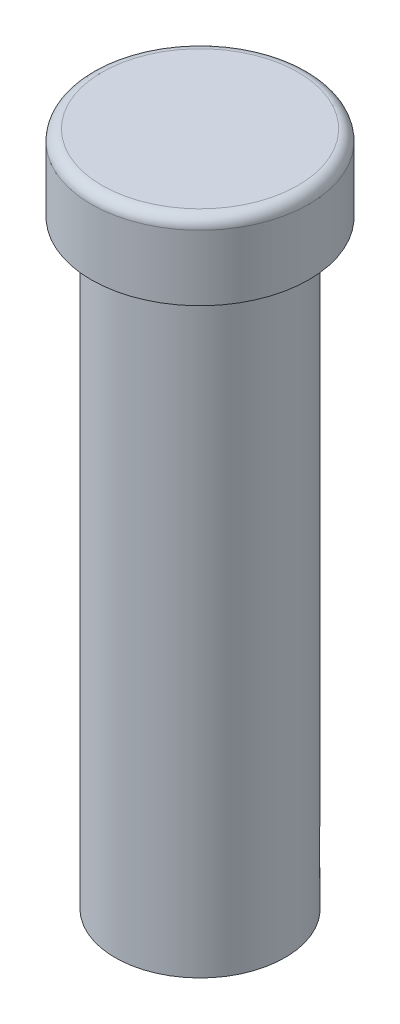
ISO-10303-21;
HEADER;
FILE_DESCRIPTION(('STEP AP214'),'2;1');
FILE_NAME('part.step','',(''),(''),'','','');
FILE_SCHEMA(('AUTOMOTIVE_DESIGN { 1 0 10303 214 1 1 1 1 }'));
ENDSEC;
DATA;
#1=APPLICATION_CONTEXT('core data for automotive mechanical design processes');
#2=APPLICATION_PROTOCOL_DEFINITION('international standard','automotive_design',2000,#1);
#3=PRODUCT_CONTEXT('',#1,'mechanical');
#4=PRODUCT('Part','Part','',(#3));
#5=PRODUCT_RELATED_PRODUCT_CATEGORY('part','',(#4));
#6=PRODUCT_DEFINITION_FORMATION('','',#4);
#7=PRODUCT_DEFINITION_CONTEXT('part definition',#1,'design');
#8=PRODUCT_DEFINITION('design','',#6,#7);
#9=PRODUCT_DEFINITION_SHAPE('','',#8);
#10=(LENGTH_UNIT() NAMED_UNIT(*) SI_UNIT(.MILLI.,.METRE.));
#11=(NAMED_UNIT(*) PLANE_ANGLE_UNIT() SI_UNIT($,.RADIAN.));
#12=(NAMED_UNIT(*) SI_UNIT($,.STERADIAN.) SOLID_ANGLE_UNIT());
#13=UNCERTAINTY_MEASURE_WITH_UNIT(LENGTH_MEASURE(1.E-05),#10,'distance_accuracy_value','');
#14=(GEOMETRIC_REPRESENTATION_CONTEXT(3) GLOBAL_UNCERTAINTY_ASSIGNED_CONTEXT((#13)) GLOBAL_UNIT_ASSIGNED_CONTEXT((#10,
#11,#12)) REPRESENTATION_CONTEXT('',''));
#15=CARTESIAN_POINT('',(0.,0.,0.));
#16=DIRECTION('',(0.,0.,1.));
#17=DIRECTION('',(1.,0.,0.));
#18=AXIS2_PLACEMENT_3D('',#15,#16,#17);
#19=CARTESIAN_POINT('',(0.,-69.85,0.));
#20=DIRECTION('',(0.,1.,0.));
#21=DIRECTION('',(0.,0.,1.));
#22=AXIS2_PLACEMENT_3D('',#19,#20,#21);
#23=CYLINDRICAL_SURFACE('',#22,9.906);
#24=CARTESIAN_POINT('',(0.,0.,0.));
#25=DIRECTION('',(0.,-1.,0.));
#26=DIRECTION('',(0.,0.,-1.));
#27=AXIS2_PLACEMENT_3D('',#24,#25,#26);
#28=CIRCLE('',#27,9.906);
#29=CARTESIAN_POINT('',(0.,0.,-9.906));
#30=VERTEX_POINT('',#29);
#31=EDGE_CURVE('E81',#30,#30,#28,.T.);
#32=ORIENTED_EDGE('',*,*,#31,.T.);
#33=EDGE_LOOP('',(#32));
#34=FACE_BOUND('',#33,.T.);
#35=CARTESIAN_POINT('',(0.,-69.85,0.));
#36=DIRECTION('',(0.,-1.,0.));
#37=DIRECTION('',(0.,0.,-1.));
#38=AXIS2_PLACEMENT_3D('',#35,#36,#37);
#39=CIRCLE('',#38,9.906);
#40=CARTESIAN_POINT('',(0.,-69.85,-9.906));
#41=VERTEX_POINT('',#40);
#42=EDGE_CURVE('E85',#41,#41,#39,.T.);
#43=ORIENTED_EDGE('',*,*,#42,.F.);
#44=EDGE_LOOP('',(#43));
#45=FACE_BOUND('',#44,.T.);
#46=DIRECTION('',(0.,1.,0.));
#47=VECTOR('',#46,1.);
#48=CARTESIAN_POINT('',(-7.60304780992465,-69.85,-6.35));
#49=LINE('',#48,#47);
#50=CARTESIAN_POINT('',(-7.60304780992465,-66.1693905715168,-6.35));
#51=VERTEX_POINT('',#50);
#52=CARTESIAN_POINT('',(-7.60304780992465,-60.9776557313921,-6.35));
#53=VERTEX_POINT('',#52);
#54=EDGE_CURVE('E11',#51,#53,#49,.T.);
#55=ORIENTED_EDGE('',*,*,#54,.F.);
#56=CARTESIAN_POINT('',(0.,-66.1693905715168,0.));
#57=DIRECTION('',(0.,-1.,0.));
#58=DIRECTION('',(0.,0.,-1.));
#59=AXIS2_PLACEMENT_3D('',#56,#57,#58);
#60=CIRCLE('',#59,9.906);
#61=CARTESIAN_POINT('',(7.60304780992464,-66.1693905715168,-6.35));
#62=VERTEX_POINT('',#61);
#63=EDGE_CURVE('E62',#51,#62,#60,.T.);
#64=ORIENTED_EDGE('',*,*,#63,.T.);
#65=DIRECTION('',(0.,1.,0.));
#66=VECTOR('',#65,1.);
#67=CARTESIAN_POINT('',(7.60304780992465,-69.85,-6.35));
#68=LINE('',#67,#66);
#69=CARTESIAN_POINT('',(7.60304780992465,-60.9776557313921,-6.35));
#70=VERTEX_POINT('',#69);
#71=EDGE_CURVE('E67',#70,#62,#68,.F.);
#72=ORIENTED_EDGE('',*,*,#71,.F.);
#73=CARTESIAN_POINT('',(0.,-60.9776557313921,0.));
#74=DIRECTION('',(0.,1.,0.));
#75=DIRECTION('',(0.,0.,1.));
#76=AXIS2_PLACEMENT_3D('',#73,#74,#75);
#77=CIRCLE('',#76,9.906);
#78=EDGE_CURVE('E44',#70,#53,#77,.T.);
#79=ORIENTED_EDGE('',*,*,#78,.T.);
#80=EDGE_LOOP('',(#55,#64,#72,#79));
#81=FACE_BOUND('',#80,.T.);
#82=ADVANCED_FACE('F36',(#34,#45,#81),#23,.T.);
#83=CARTESIAN_POINT('',(0.,8.89,0.));
#84=DIRECTION('',(0.,-1.,0.));
#85=DIRECTION('',(0.,0.,-1.));
#86=AXIS2_PLACEMENT_3D('',#83,#84,#85);
#87=CYLINDRICAL_SURFACE('',#86,12.7);
#88=CARTESIAN_POINT('',(0.,7.62,0.));
#89=DIRECTION('',(0.,1.,0.));
#90=DIRECTION('',(0.,0.,1.));
#91=AXIS2_PLACEMENT_3D('',#88,#89,#90);
#92=CIRCLE('',#91,12.7);
#93=CARTESIAN_POINT('',(0.,7.62,12.7));
#94=VERTEX_POINT('',#93);
#95=EDGE_CURVE('E75',#94,#94,#92,.F.);
#96=ORIENTED_EDGE('',*,*,#95,.T.);
#97=EDGE_LOOP('',(#96));
#98=FACE_BOUND('',#97,.T.);
#99=CARTESIAN_POINT('',(0.,0.,0.));
#100=DIRECTION('',(0.,1.,0.));
#101=DIRECTION('',(0.,0.,1.));
#102=AXIS2_PLACEMENT_3D('',#99,#100,#101);
#103=CIRCLE('',#102,12.7);
#104=CARTESIAN_POINT('',(0.,0.,12.7));
#105=VERTEX_POINT('',#104);
#106=EDGE_CURVE('E82',#105,#105,#103,.T.);
#107=ORIENTED_EDGE('',*,*,#106,.T.);
#108=EDGE_LOOP('',(#107));
#109=FACE_BOUND('',#108,.T.);
#110=ADVANCED_FACE('F102',(#98,#109),#87,.T.);
#111=CARTESIAN_POINT('',(0.,8.89,0.));
#112=DIRECTION('',(0.,1.,0.));
#113=DIRECTION('',(0.,0.,1.));
#114=AXIS2_PLACEMENT_3D('',#111,#112,#113);
#115=PLANE('',#114);
#116=CARTESIAN_POINT('',(0.,8.89,0.));
#117=DIRECTION('',(0.,1.,0.));
#118=DIRECTION('',(0.,0.,1.));
#119=AXIS2_PLACEMENT_3D('',#116,#117,#118);
#120=CIRCLE('',#119,11.43);
#121=CARTESIAN_POINT('',(0.,8.89,11.43));
#122=VERTEX_POINT('',#121);
#123=EDGE_CURVE('E78',#122,#122,#120,.T.);
#124=ORIENTED_EDGE('',*,*,#123,.T.);
#125=EDGE_LOOP('',(#124));
#126=FACE_BOUND('',#125,.T.);
#127=ADVANCED_FACE('F108',(#126),#115,.T.);
#128=CARTESIAN_POINT('',(0.,0.,0.));
#129=DIRECTION('',(0.,1.,0.));
#130=DIRECTION('',(0.,0.,1.));
#131=AXIS2_PLACEMENT_3D('',#128,#129,#130);
#132=PLANE('',#131);
#133=ORIENTED_EDGE('',*,*,#31,.F.);
#134=EDGE_LOOP('',(#133));
#135=FACE_BOUND('',#134,.T.);
#136=ORIENTED_EDGE('',*,*,#106,.F.);
#137=EDGE_LOOP('',(#136));
#138=FACE_BOUND('',#137,.T.);
#139=ADVANCED_FACE('F115',(#135,#138),#132,.F.);
#140=CARTESIAN_POINT('',(0.,-69.85,0.));
#141=DIRECTION('',(0.,-1.,0.));
#142=DIRECTION('',(0.,0.,-1.));
#143=AXIS2_PLACEMENT_3D('',#140,#141,#142);
#144=PLANE('',#143);
#145=ORIENTED_EDGE('',*,*,#42,.T.);
#146=EDGE_LOOP('',(#145));
#147=FACE_BOUND('',#146,.T.);
#148=ADVANCED_FACE('F98',(#147),#144,.T.);
#149=CARTESIAN_POINT('',(0.,7.62,0.));
#150=DIRECTION('',(0.,1.,0.));
#151=DIRECTION('',(0.,0.,1.));
#152=AXIS2_PLACEMENT_3D('',#149,#150,#151);
#153=TOROIDAL_SURFACE('',#152,11.43,1.27);
#154=ORIENTED_EDGE('',*,*,#95,.F.);
#155=EDGE_LOOP('',(#154));
#156=FACE_BOUND('',#155,.T.);
#157=ORIENTED_EDGE('',*,*,#123,.F.);
#158=EDGE_LOOP('',(#157));
#159=FACE_BOUND('',#158,.T.);
#160=ADVANCED_FACE('F38',(#156,#159),#153,.T.);
#161=CARTESIAN_POINT('',(-12.6593099087344,-60.9776557313921,-76.2));
#162=DIRECTION('',(0.,1.,0.));
#163=DIRECTION('',(0.,0.,1.));
#164=AXIS2_PLACEMENT_3D('',#161,#162,#163);
#165=PLANE('',#164);
#166=DIRECTION('',(-1.,0.,0.));
#167=VECTOR('',#166,1.);
#168=CARTESIAN_POINT('',(-12.6593099087344,-60.9776557313921,-6.35));
#169=LINE('',#168,#167);
#170=EDGE_CURVE('E50',#70,#53,#169,.T.);
#171=ORIENTED_EDGE('',*,*,#170,.T.);
#172=ORIENTED_EDGE('',*,*,#78,.F.);
#173=EDGE_LOOP('',(#171,#172));
#174=FACE_BOUND('',#173,.T.);
#175=ADVANCED_FACE('F90',(#174),#165,.F.);
#176=CARTESIAN_POINT('',(-12.6593099087344,-66.1693905715168,-76.2));
#177=DIRECTION('',(0.,-1.,0.));
#178=DIRECTION('',(0.,0.,-1.));
#179=AXIS2_PLACEMENT_3D('',#176,#177,#178);
#180=PLANE('',#179);
#181=DIRECTION('',(1.,0.,0.));
#182=VECTOR('',#181,1.);
#183=CARTESIAN_POINT('',(-12.6593099087344,-66.1693905715168,-6.35));
#184=LINE('',#183,#182);
#185=EDGE_CURVE('E64',#51,#62,#184,.T.);
#186=ORIENTED_EDGE('',*,*,#185,.T.);
#187=ORIENTED_EDGE('',*,*,#63,.F.);
#188=EDGE_LOOP('',(#186,#187));
#189=FACE_BOUND('',#188,.T.);
#190=ADVANCED_FACE('F63',(#189),#180,.F.);
#191=CARTESIAN_POINT('',(0.,0.,-6.35));
#192=DIRECTION('',(0.,0.,-1.));
#193=DIRECTION('',(-1.,0.,0.));
#194=AXIS2_PLACEMENT_3D('',#191,#192,#193);
#195=PLANE('',#194);
#196=ORIENTED_EDGE('',*,*,#54,.T.);
#197=ORIENTED_EDGE('',*,*,#170,.F.);
#198=ORIENTED_EDGE('',*,*,#71,.T.);
#199=ORIENTED_EDGE('',*,*,#185,.F.);
#200=EDGE_LOOP('',(#196,#197,#198,#199));
#201=FACE_BOUND('',#200,.T.);
#202=ADVANCED_FACE('F69',(#201),#195,.T.);
#203=CLOSED_SHELL('',(#82,#110,#127,#139,#148,#160,#175,#190,#202));
#204=MANIFOLD_SOLID_BREP('B2',#203);
#205=ADVANCED_BREP_SHAPE_REPRESENTATION('',(#18,#204),#14);
#206=SHAPE_DEFINITION_REPRESENTATION(#9,#205);
ENDSEC;
END-ISO-10303-21;
